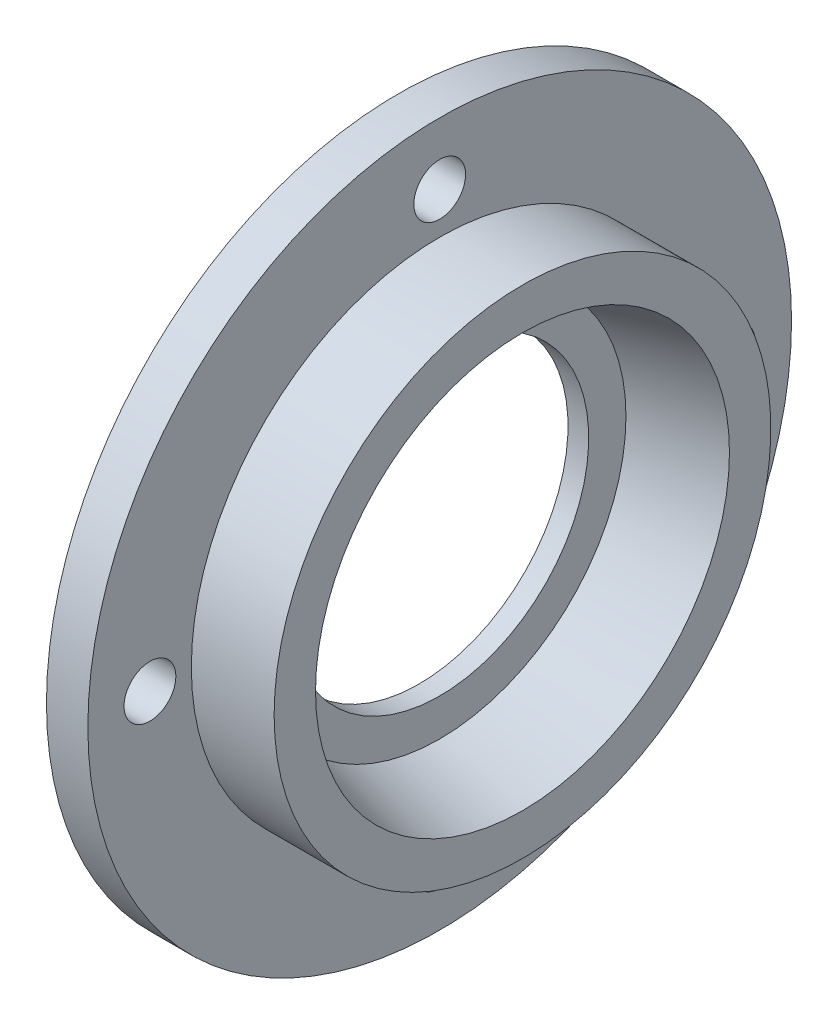
ISO-10303-21;
HEADER;
FILE_DESCRIPTION(('STEP AP214'),'2;1');
FILE_NAME('part.step','',(''),(''),'','','');
FILE_SCHEMA(('AUTOMOTIVE_DESIGN { 1 0 10303 214 1 1 1 1 }'));
ENDSEC;
DATA;
#1=APPLICATION_CONTEXT('core data for automotive mechanical design processes');
#2=APPLICATION_PROTOCOL_DEFINITION('international standard','automotive_design',2000,#1);
#3=PRODUCT_CONTEXT('',#1,'mechanical');
#4=PRODUCT('Part','Part','',(#3));
#5=PRODUCT_RELATED_PRODUCT_CATEGORY('part','',(#4));
#6=PRODUCT_DEFINITION_FORMATION('','',#4);
#7=PRODUCT_DEFINITION_CONTEXT('part definition',#1,'design');
#8=PRODUCT_DEFINITION('design','',#6,#7);
#9=PRODUCT_DEFINITION_SHAPE('','',#8);
#10=(LENGTH_UNIT() NAMED_UNIT(*) SI_UNIT(.MILLI.,.METRE.));
#11=(NAMED_UNIT(*) PLANE_ANGLE_UNIT() SI_UNIT($,.RADIAN.));
#12=(NAMED_UNIT(*) SI_UNIT($,.STERADIAN.) SOLID_ANGLE_UNIT());
#13=UNCERTAINTY_MEASURE_WITH_UNIT(LENGTH_MEASURE(1.E-05),#10,'distance_accuracy_value','');
#14=(GEOMETRIC_REPRESENTATION_CONTEXT(3) GLOBAL_UNCERTAINTY_ASSIGNED_CONTEXT((#13)) GLOBAL_UNIT_ASSIGNED_CONTEXT((#10,
#11,#12)) REPRESENTATION_CONTEXT('',''));
#15=CARTESIAN_POINT('',(0.,0.,0.));
#16=DIRECTION('',(0.,0.,1.));
#17=DIRECTION('',(1.,0.,0.));
#18=AXIS2_PLACEMENT_3D('',#15,#16,#17);
#19=CARTESIAN_POINT('',(0.,0.,0.));
#20=DIRECTION('',(1.,0.,0.));
#21=DIRECTION('',(0.,0.,-1.));
#22=AXIS2_PLACEMENT_3D('',#19,#20,#21);
#23=PLANE('',#22);
#24=CARTESIAN_POINT('',(0.,0.,0.));
#25=DIRECTION('',(-1.,0.,0.));
#26=DIRECTION('',(0.,0.,1.));
#27=AXIS2_PLACEMENT_3D('',#24,#25,#26);
#28=CIRCLE('',#27,12.);
#29=CARTESIAN_POINT('',(0.,0.,12.));
#30=VERTEX_POINT('',#29);
#31=EDGE_CURVE('E101',#30,#30,#28,.T.);
#32=ORIENTED_EDGE('',*,*,#31,.F.);
#33=EDGE_LOOP('',(#32));
#34=FACE_BOUND('',#33,.T.);
#35=CARTESIAN_POINT('',(0.,14.,0.));
#36=DIRECTION('',(-1.,0.,0.));
#37=DIRECTION('',(0.,0.,1.));
#38=AXIS2_PLACEMENT_3D('',#35,#36,#37);
#39=CIRCLE('',#38,1.25);
#40=CARTESIAN_POINT('',(0.,14.,1.25));
#41=VERTEX_POINT('',#40);
#42=EDGE_CURVE('E91',#41,#41,#39,.T.);
#43=ORIENTED_EDGE('',*,*,#42,.F.);
#44=EDGE_LOOP('',(#43));
#45=FACE_BOUND('',#44,.T.);
#46=CARTESIAN_POINT('',(0.,0.,14.));
#47=DIRECTION('',(-1.,0.,0.));
#48=DIRECTION('',(0.,0.,1.));
#49=AXIS2_PLACEMENT_3D('',#46,#47,#48);
#50=CIRCLE('',#49,1.25);
#51=CARTESIAN_POINT('',(0.,0.,15.25));
#52=VERTEX_POINT('',#51);
#53=EDGE_CURVE('E83',#52,#52,#50,.T.);
#54=ORIENTED_EDGE('',*,*,#53,.F.);
#55=EDGE_LOOP('',(#54));
#56=FACE_BOUND('',#55,.T.);
#57=CARTESIAN_POINT('',(0.,-14.,0.));
#58=DIRECTION('',(-1.,0.,0.));
#59=DIRECTION('',(0.,0.,1.));
#60=AXIS2_PLACEMENT_3D('',#57,#58,#59);
#61=CIRCLE('',#60,1.25);
#62=CARTESIAN_POINT('',(0.,-14.,1.25));
#63=VERTEX_POINT('',#62);
#64=EDGE_CURVE('E73',#63,#63,#61,.T.);
#65=ORIENTED_EDGE('',*,*,#64,.F.);
#66=EDGE_LOOP('',(#65));
#67=FACE_BOUND('',#66,.T.);
#68=CARTESIAN_POINT('',(0.,0.,-14.));
#69=DIRECTION('',(-1.,0.,0.));
#70=DIRECTION('',(0.,0.,1.));
#71=AXIS2_PLACEMENT_3D('',#68,#69,#70);
#72=CIRCLE('',#71,1.25);
#73=CARTESIAN_POINT('',(0.,0.,-12.75));
#74=VERTEX_POINT('',#73);
#75=EDGE_CURVE('E74',#74,#74,#72,.T.);
#76=ORIENTED_EDGE('',*,*,#75,.F.);
#77=EDGE_LOOP('',(#76));
#78=FACE_BOUND('',#77,.T.);
#79=CARTESIAN_POINT('',(0.,0.,0.));
#80=DIRECTION('',(-1.,0.,0.));
#81=DIRECTION('',(0.,0.,1.));
#82=AXIS2_PLACEMENT_3D('',#79,#80,#81);
#83=CIRCLE('',#82,17.);
#84=CARTESIAN_POINT('',(0.,0.,17.));
#85=VERTEX_POINT('',#84);
#86=EDGE_CURVE('E10',#85,#85,#83,.T.);
#87=ORIENTED_EDGE('',*,*,#86,.T.);
#88=EDGE_LOOP('',(#87));
#89=FACE_BOUND('',#88,.T.);
#90=ADVANCED_FACE('F37',(#34,#45,#56,#67,#78,#89),#23,.F.);
#91=CARTESIAN_POINT('',(0.,0.,0.));
#92=DIRECTION('',(-1.,0.,0.));
#93=DIRECTION('',(0.,0.,1.));
#94=AXIS2_PLACEMENT_3D('',#91,#92,#93);
#95=CYLINDRICAL_SURFACE('',#94,17.);
#96=ORIENTED_EDGE('',*,*,#86,.F.);
#97=EDGE_LOOP('',(#96));
#98=FACE_BOUND('',#97,.T.);
#99=CARTESIAN_POINT('',(2.,0.,0.));
#100=DIRECTION('',(-1.,0.,0.));
#101=DIRECTION('',(0.,0.,1.));
#102=AXIS2_PLACEMENT_3D('',#99,#100,#101);
#103=CIRCLE('',#102,17.);
#104=CARTESIAN_POINT('',(2.,0.,17.));
#105=VERTEX_POINT('',#104);
#106=EDGE_CURVE('E44',#105,#105,#103,.T.);
#107=ORIENTED_EDGE('',*,*,#106,.T.);
#108=EDGE_LOOP('',(#107));
#109=FACE_BOUND('',#108,.T.);
#110=ADVANCED_FACE('F135',(#98,#109),#95,.T.);
#111=CARTESIAN_POINT('',(2.,17.,0.));
#112=DIRECTION('',(-1.,0.,0.));
#113=DIRECTION('',(0.,0.,1.));
#114=AXIS2_PLACEMENT_3D('',#111,#112,#113);
#115=PLANE('',#114);
#116=CARTESIAN_POINT('',(2.,14.,0.));
#117=DIRECTION('',(-1.,0.,0.));
#118=DIRECTION('',(0.,0.,1.));
#119=AXIS2_PLACEMENT_3D('',#116,#117,#118);
#120=CIRCLE('',#119,1.25);
#121=CARTESIAN_POINT('',(2.,14.,1.25));
#122=VERTEX_POINT('',#121);
#123=EDGE_CURVE('E68',#122,#122,#120,.F.);
#124=ORIENTED_EDGE('',*,*,#123,.F.);
#125=EDGE_LOOP('',(#124));
#126=FACE_BOUND('',#125,.T.);
#127=CARTESIAN_POINT('',(2.,0.,14.));
#128=DIRECTION('',(-1.,0.,0.));
#129=DIRECTION('',(0.,0.,1.));
#130=AXIS2_PLACEMENT_3D('',#127,#128,#129);
#131=CIRCLE('',#130,1.25);
#132=CARTESIAN_POINT('',(2.,0.,15.25));
#133=VERTEX_POINT('',#132);
#134=EDGE_CURVE('E87',#133,#133,#131,.F.);
#135=ORIENTED_EDGE('',*,*,#134,.F.);
#136=EDGE_LOOP('',(#135));
#137=FACE_BOUND('',#136,.T.);
#138=CARTESIAN_POINT('',(2.,-14.,0.));
#139=DIRECTION('',(-1.,0.,0.));
#140=DIRECTION('',(0.,0.,1.));
#141=AXIS2_PLACEMENT_3D('',#138,#139,#140);
#142=CIRCLE('',#141,1.25);
#143=CARTESIAN_POINT('',(2.,-14.,1.25));
#144=VERTEX_POINT('',#143);
#145=EDGE_CURVE('E79',#144,#144,#142,.F.);
#146=ORIENTED_EDGE('',*,*,#145,.F.);
#147=EDGE_LOOP('',(#146));
#148=FACE_BOUND('',#147,.T.);
#149=CARTESIAN_POINT('',(2.,0.,-14.));
#150=DIRECTION('',(-1.,0.,0.));
#151=DIRECTION('',(0.,0.,1.));
#152=AXIS2_PLACEMENT_3D('',#149,#150,#151);
#153=CIRCLE('',#152,1.25);
#154=CARTESIAN_POINT('',(2.,0.,-12.75));
#155=VERTEX_POINT('',#154);
#156=EDGE_CURVE('E69',#155,#155,#153,.F.);
#157=ORIENTED_EDGE('',*,*,#156,.F.);
#158=EDGE_LOOP('',(#157));
#159=FACE_BOUND('',#158,.T.);
#160=ORIENTED_EDGE('',*,*,#106,.F.);
#161=EDGE_LOOP('',(#160));
#162=FACE_BOUND('',#161,.T.);
#163=CARTESIAN_POINT('',(2.,0.,0.));
#164=DIRECTION('',(-1.,0.,0.));
#165=DIRECTION('',(0.,0.,1.));
#166=AXIS2_PLACEMENT_3D('',#163,#164,#165);
#167=CIRCLE('',#166,12.);
#168=CARTESIAN_POINT('',(2.,0.,12.));
#169=VERTEX_POINT('',#168);
#170=EDGE_CURVE('E49',#169,#169,#167,.T.);
#171=ORIENTED_EDGE('',*,*,#170,.T.);
#172=EDGE_LOOP('',(#171));
#173=FACE_BOUND('',#172,.T.);
#174=ADVANCED_FACE('F152',(#126,#137,#148,#159,#162,#173),#115,.F.);
#175=CARTESIAN_POINT('',(0.,0.,0.));
#176=DIRECTION('',(-1.,0.,0.));
#177=DIRECTION('',(0.,0.,1.));
#178=AXIS2_PLACEMENT_3D('',#175,#176,#177);
#179=CYLINDRICAL_SURFACE('',#178,12.);
#180=ORIENTED_EDGE('',*,*,#170,.F.);
#181=EDGE_LOOP('',(#180));
#182=FACE_BOUND('',#181,.T.);
#183=CARTESIAN_POINT('',(6.,0.,0.));
#184=DIRECTION('',(-1.,0.,0.));
#185=DIRECTION('',(0.,0.,1.));
#186=AXIS2_PLACEMENT_3D('',#183,#184,#185);
#187=CIRCLE('',#186,12.);
#188=CARTESIAN_POINT('',(6.,0.,12.));
#189=VERTEX_POINT('',#188);
#190=EDGE_CURVE('E54',#189,#189,#187,.T.);
#191=ORIENTED_EDGE('',*,*,#190,.T.);
#192=EDGE_LOOP('',(#191));
#193=FACE_BOUND('',#192,.T.);
#194=ADVANCED_FACE('F155',(#182,#193),#179,.T.);
#195=CARTESIAN_POINT('',(6.,12.,0.));
#196=DIRECTION('',(-1.,0.,0.));
#197=DIRECTION('',(0.,0.,1.));
#198=AXIS2_PLACEMENT_3D('',#195,#196,#197);
#199=PLANE('',#198);
#200=ORIENTED_EDGE('',*,*,#190,.F.);
#201=EDGE_LOOP('',(#200));
#202=FACE_BOUND('',#201,.T.);
#203=CARTESIAN_POINT('',(6.,0.,0.));
#204=DIRECTION('',(-1.,0.,0.));
#205=DIRECTION('',(0.,0.,1.));
#206=AXIS2_PLACEMENT_3D('',#203,#204,#205);
#207=CIRCLE('',#206,10.);
#208=CARTESIAN_POINT('',(6.,0.,10.));
#209=VERTEX_POINT('',#208);
#210=EDGE_CURVE('E60',#209,#209,#207,.T.);
#211=ORIENTED_EDGE('',*,*,#210,.T.);
#212=EDGE_LOOP('',(#211));
#213=FACE_BOUND('',#212,.T.);
#214=ADVANCED_FACE('F163',(#202,#213),#199,.F.);
#215=CARTESIAN_POINT('',(2.,0.,0.));
#216=DIRECTION('',(1.,0.,0.));
#217=DIRECTION('',(0.,0.,-1.));
#218=AXIS2_PLACEMENT_3D('',#215,#216,#217);
#219=CONICAL_SURFACE('',#218,9.,0.244978663126864);
#220=ORIENTED_EDGE('',*,*,#210,.F.);
#221=EDGE_LOOP('',(#220));
#222=FACE_BOUND('',#221,.T.);
#223=CARTESIAN_POINT('',(2.,0.,0.));
#224=DIRECTION('',(-1.,0.,0.));
#225=DIRECTION('',(0.,0.,1.));
#226=AXIS2_PLACEMENT_3D('',#223,#224,#225);
#227=CIRCLE('',#226,9.);
#228=CARTESIAN_POINT('',(2.,0.,9.));
#229=VERTEX_POINT('',#228);
#230=EDGE_CURVE('E64',#229,#229,#227,.T.);
#231=ORIENTED_EDGE('',*,*,#230,.T.);
#232=EDGE_LOOP('',(#231));
#233=FACE_BOUND('',#232,.T.);
#234=ADVANCED_FACE('F169',(#222,#233),#219,.F.);
#235=CARTESIAN_POINT('',(2.,9.,0.));
#236=DIRECTION('',(-1.,0.,0.));
#237=DIRECTION('',(0.,0.,1.));
#238=AXIS2_PLACEMENT_3D('',#235,#236,#237);
#239=PLANE('',#238);
#240=CARTESIAN_POINT('',(2.,0.,0.));
#241=DIRECTION('',(-1.,0.,0.));
#242=DIRECTION('',(0.,0.,1.));
#243=AXIS2_PLACEMENT_3D('',#240,#241,#242);
#244=CIRCLE('',#243,7.2);
#245=CARTESIAN_POINT('',(2.,0.,7.2));
#246=VERTEX_POINT('',#245);
#247=EDGE_CURVE('E105',#246,#246,#244,.F.);
#248=ORIENTED_EDGE('',*,*,#247,.F.);
#249=EDGE_LOOP('',(#248));
#250=FACE_BOUND('',#249,.T.);
#251=ORIENTED_EDGE('',*,*,#230,.F.);
#252=EDGE_LOOP('',(#251));
#253=FACE_BOUND('',#252,.T.);
#254=ADVANCED_FACE('F148',(#250,#253),#239,.F.);
#255=CARTESIAN_POINT('',(6.001,0.,-14.));
#256=DIRECTION('',(-1.,0.,0.));
#257=DIRECTION('',(0.,0.,1.));
#258=AXIS2_PLACEMENT_3D('',#255,#256,#257);
#259=CYLINDRICAL_SURFACE('',#258,1.25);
#260=ORIENTED_EDGE('',*,*,#75,.T.);
#261=EDGE_LOOP('',(#260));
#262=FACE_BOUND('',#261,.T.);
#263=ORIENTED_EDGE('',*,*,#156,.T.);
#264=EDGE_LOOP('',(#263));
#265=FACE_BOUND('',#264,.T.);
#266=ADVANCED_FACE('F144',(#262,#265),#259,.F.);
#267=CARTESIAN_POINT('',(6.001,-14.,0.));
#268=DIRECTION('',(-1.,0.,0.));
#269=DIRECTION('',(0.,0.,1.));
#270=AXIS2_PLACEMENT_3D('',#267,#268,#269);
#271=CYLINDRICAL_SURFACE('',#270,1.25);
#272=ORIENTED_EDGE('',*,*,#64,.T.);
#273=EDGE_LOOP('',(#272));
#274=FACE_BOUND('',#273,.T.);
#275=ORIENTED_EDGE('',*,*,#145,.T.);
#276=EDGE_LOOP('',(#275));
#277=FACE_BOUND('',#276,.T.);
#278=ADVANCED_FACE('F147',(#274,#277),#271,.F.);
#279=CARTESIAN_POINT('',(6.001,0.,14.));
#280=DIRECTION('',(-1.,0.,0.));
#281=DIRECTION('',(0.,0.,1.));
#282=AXIS2_PLACEMENT_3D('',#279,#280,#281);
#283=CYLINDRICAL_SURFACE('',#282,1.25);
#284=ORIENTED_EDGE('',*,*,#53,.T.);
#285=EDGE_LOOP('',(#284));
#286=FACE_BOUND('',#285,.T.);
#287=ORIENTED_EDGE('',*,*,#134,.T.);
#288=EDGE_LOOP('',(#287));
#289=FACE_BOUND('',#288,.T.);
#290=ADVANCED_FACE('F230',(#286,#289),#283,.F.);
#291=CARTESIAN_POINT('',(6.001,14.,0.));
#292=DIRECTION('',(-1.,0.,0.));
#293=DIRECTION('',(0.,0.,1.));
#294=AXIS2_PLACEMENT_3D('',#291,#292,#293);
#295=CYLINDRICAL_SURFACE('',#294,1.25);
#296=ORIENTED_EDGE('',*,*,#42,.T.);
#297=EDGE_LOOP('',(#296));
#298=FACE_BOUND('',#297,.T.);
#299=ORIENTED_EDGE('',*,*,#123,.T.);
#300=EDGE_LOOP('',(#299));
#301=FACE_BOUND('',#300,.T.);
#302=ADVANCED_FACE('F129',(#298,#301),#295,.F.);
#303=CARTESIAN_POINT('',(1.,0.,0.));
#304=DIRECTION('',(-1.,0.,0.));
#305=DIRECTION('',(0.,0.,1.));
#306=AXIS2_PLACEMENT_3D('',#303,#304,#305);
#307=CYLINDRICAL_SURFACE('',#306,12.);
#308=CARTESIAN_POINT('',(1.,0.,0.));
#309=DIRECTION('',(-1.,0.,0.));
#310=DIRECTION('',(0.,0.,1.));
#311=AXIS2_PLACEMENT_3D('',#308,#309,#310);
#312=CIRCLE('',#311,12.);
#313=CARTESIAN_POINT('',(1.,0.,12.));
#314=VERTEX_POINT('',#313);
#315=EDGE_CURVE('E78',#314,#314,#312,.T.);
#316=ORIENTED_EDGE('',*,*,#315,.F.);
#317=EDGE_LOOP('',(#316));
#318=FACE_BOUND('',#317,.T.);
#319=ORIENTED_EDGE('',*,*,#31,.T.);
#320=EDGE_LOOP('',(#319));
#321=FACE_BOUND('',#320,.T.);
#322=ADVANCED_FACE('F123',(#318,#321),#307,.F.);
#323=CARTESIAN_POINT('',(1.,0.,0.));
#324=DIRECTION('',(-1.,0.,0.));
#325=DIRECTION('',(0.,0.,1.));
#326=AXIS2_PLACEMENT_3D('',#323,#324,#325);
#327=PLANE('',#326);
#328=CARTESIAN_POINT('',(1.,0.,0.));
#329=DIRECTION('',(-1.,0.,0.));
#330=DIRECTION('',(0.,0.,1.));
#331=AXIS2_PLACEMENT_3D('',#328,#329,#330);
#332=CIRCLE('',#331,7.2);
#333=CARTESIAN_POINT('',(1.,0.,7.2));
#334=VERTEX_POINT('',#333);
#335=EDGE_CURVE('E112',#334,#334,#332,.T.);
#336=ORIENTED_EDGE('',*,*,#335,.F.);
#337=EDGE_LOOP('',(#336));
#338=FACE_BOUND('',#337,.T.);
#339=ORIENTED_EDGE('',*,*,#315,.T.);
#340=EDGE_LOOP('',(#339));
#341=FACE_BOUND('',#340,.T.);
#342=ADVANCED_FACE('F120',(#338,#341),#327,.T.);
#343=CARTESIAN_POINT('',(6.001,0.,0.));
#344=DIRECTION('',(-1.,0.,0.));
#345=DIRECTION('',(0.,0.,1.));
#346=AXIS2_PLACEMENT_3D('',#343,#344,#345);
#347=CYLINDRICAL_SURFACE('',#346,7.2);
#348=ORIENTED_EDGE('',*,*,#335,.T.);
#349=EDGE_LOOP('',(#348));
#350=FACE_BOUND('',#349,.T.);
#351=ORIENTED_EDGE('',*,*,#247,.T.);
#352=EDGE_LOOP('',(#351));
#353=FACE_BOUND('',#352,.T.);
#354=ADVANCED_FACE('F117',(#350,#353),#347,.F.);
#355=CLOSED_SHELL('',(#90,#110,#174,#194,#214,#234,#254,#266,#278,#290,#302,#322,#342,#354));
#356=MANIFOLD_SOLID_BREP('B2',#355);
#357=ADVANCED_BREP_SHAPE_REPRESENTATION('',(#18,#356),#14);
#358=SHAPE_DEFINITION_REPRESENTATION(#9,#357);
ENDSEC;
END-ISO-10303-21;
